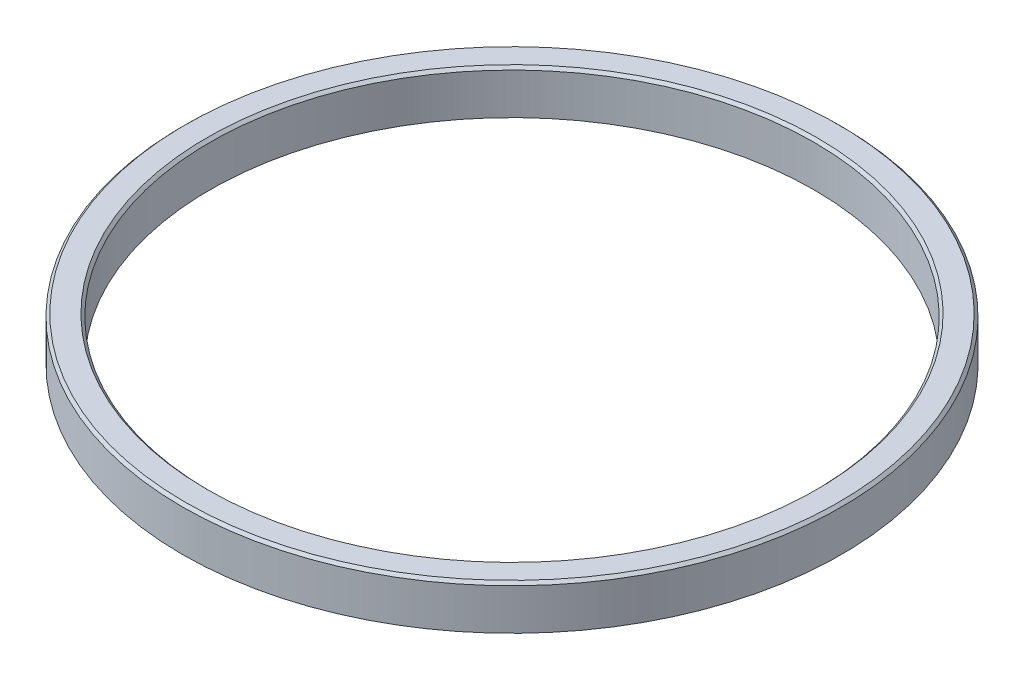
ISO-10303-21;
HEADER;
FILE_DESCRIPTION(('STEP AP214'),'2;1');
FILE_NAME('part.step','',(''),(''),'','','');
FILE_SCHEMA(('AUTOMOTIVE_DESIGN { 1 0 10303 214 1 1 1 1 }'));
ENDSEC;
DATA;
#1=APPLICATION_CONTEXT('core data for automotive mechanical design processes');
#2=APPLICATION_PROTOCOL_DEFINITION('international standard','automotive_design',2000,#1);
#3=PRODUCT_CONTEXT('',#1,'mechanical');
#4=PRODUCT('Part','Part','',(#3));
#5=PRODUCT_RELATED_PRODUCT_CATEGORY('part','',(#4));
#6=PRODUCT_DEFINITION_FORMATION('','',#4);
#7=PRODUCT_DEFINITION_CONTEXT('part definition',#1,'design');
#8=PRODUCT_DEFINITION('design','',#6,#7);
#9=PRODUCT_DEFINITION_SHAPE('','',#8);
#10=(LENGTH_UNIT() NAMED_UNIT(*) SI_UNIT(.MILLI.,.METRE.));
#11=(NAMED_UNIT(*) PLANE_ANGLE_UNIT() SI_UNIT($,.RADIAN.));
#12=(NAMED_UNIT(*) SI_UNIT($,.STERADIAN.) SOLID_ANGLE_UNIT());
#13=UNCERTAINTY_MEASURE_WITH_UNIT(LENGTH_MEASURE(1.E-05),#10,'distance_accuracy_value','');
#14=(GEOMETRIC_REPRESENTATION_CONTEXT(3) GLOBAL_UNCERTAINTY_ASSIGNED_CONTEXT((#13)) GLOBAL_UNIT_ASSIGNED_CONTEXT((#10,
#11,#12)) REPRESENTATION_CONTEXT('',''));
#15=CARTESIAN_POINT('',(0.,0.,0.));
#16=DIRECTION('',(0.,0.,1.));
#17=DIRECTION('',(1.,0.,0.));
#18=AXIS2_PLACEMENT_3D('',#15,#16,#17);
#19=CARTESIAN_POINT('',(0.,9.525,0.));
#20=DIRECTION('',(0.,1.,0.));
#21=DIRECTION('',(0.,0.,1.));
#22=AXIS2_PLACEMENT_3D('',#19,#20,#21);
#23=CONICAL_SURFACE('',#22,69.85,0.785398163397448);
#24=CARTESIAN_POINT('',(0.,9.525,0.));
#25=DIRECTION('',(0.,1.,0.));
#26=DIRECTION('',(0.,0.,1.));
#27=AXIS2_PLACEMENT_3D('',#24,#25,#26);
#28=CIRCLE('',#27,69.85);
#29=CARTESIAN_POINT('',(0.,9.525,69.85));
#30=VERTEX_POINT('',#29);
#31=EDGE_CURVE('E43',#30,#30,#28,.T.);
#32=ORIENTED_EDGE('',*,*,#31,.F.);
#33=EDGE_LOOP('',(#32));
#34=FACE_BOUND('',#33,.T.);
#35=CARTESIAN_POINT('',(0.,10.16,0.));
#36=DIRECTION('',(0.,1.,0.));
#37=DIRECTION('',(0.,0.,1.));
#38=AXIS2_PLACEMENT_3D('',#35,#36,#37);
#39=CIRCLE('',#38,70.485);
#40=CARTESIAN_POINT('',(0.,10.16,70.485));
#41=VERTEX_POINT('',#40);
#42=EDGE_CURVE('E12',#41,#41,#39,.F.);
#43=ORIENTED_EDGE('',*,*,#42,.F.);
#44=EDGE_LOOP('',(#43));
#45=FACE_BOUND('',#44,.T.);
#46=ADVANCED_FACE('F37',(#34,#45),#23,.F.);
#47=CARTESIAN_POINT('',(0.,9.525,0.));
#48=DIRECTION('',(0.,-1.,0.));
#49=DIRECTION('',(0.,0.,-1.));
#50=AXIS2_PLACEMENT_3D('',#47,#48,#49);
#51=CONICAL_SURFACE('',#50,76.2,0.785398163397448);
#52=CARTESIAN_POINT('',(0.,9.525,0.));
#53=DIRECTION('',(0.,1.,0.));
#54=DIRECTION('',(0.,0.,1.));
#55=AXIS2_PLACEMENT_3D('',#52,#53,#54);
#56=CIRCLE('',#55,76.2);
#57=CARTESIAN_POINT('',(0.,9.525,76.2));
#58=VERTEX_POINT('',#57);
#59=EDGE_CURVE('E51',#58,#58,#56,.F.);
#60=ORIENTED_EDGE('',*,*,#59,.F.);
#61=EDGE_LOOP('',(#60));
#62=FACE_BOUND('',#61,.T.);
#63=CARTESIAN_POINT('',(0.,10.16,0.));
#64=DIRECTION('',(0.,1.,0.));
#65=DIRECTION('',(0.,0.,1.));
#66=AXIS2_PLACEMENT_3D('',#63,#64,#65);
#67=CIRCLE('',#66,75.565);
#68=CARTESIAN_POINT('',(0.,10.16,75.565));
#69=VERTEX_POINT('',#68);
#70=EDGE_CURVE('E47',#69,#69,#67,.T.);
#71=ORIENTED_EDGE('',*,*,#70,.F.);
#72=EDGE_LOOP('',(#71));
#73=FACE_BOUND('',#72,.T.);
#74=ADVANCED_FACE('F76',(#62,#73),#51,.T.);
#75=CARTESIAN_POINT('',(0.,10.16,0.));
#76=DIRECTION('',(0.,1.,0.));
#77=DIRECTION('',(0.,0.,1.));
#78=AXIS2_PLACEMENT_3D('',#75,#76,#77);
#79=PLANE('',#78);
#80=ORIENTED_EDGE('',*,*,#42,.T.);
#81=EDGE_LOOP('',(#80));
#82=FACE_BOUND('',#81,.T.);
#83=ORIENTED_EDGE('',*,*,#70,.T.);
#84=EDGE_LOOP('',(#83));
#85=FACE_BOUND('',#84,.T.);
#86=ADVANCED_FACE('F81',(#82,#85),#79,.T.);
#87=CARTESIAN_POINT('',(0.,0.,0.));
#88=DIRECTION('',(0.,1.,0.));
#89=DIRECTION('',(0.,0.,1.));
#90=AXIS2_PLACEMENT_3D('',#87,#88,#89);
#91=PLANE('',#90);
#92=CARTESIAN_POINT('',(0.,0.,0.));
#93=DIRECTION('',(0.,1.,0.));
#94=DIRECTION('',(0.,0.,1.));
#95=AXIS2_PLACEMENT_3D('',#92,#93,#94);
#96=CIRCLE('',#95,76.2);
#97=CARTESIAN_POINT('',(0.,0.,76.2));
#98=VERTEX_POINT('',#97);
#99=EDGE_CURVE('E56',#98,#98,#96,.T.);
#100=ORIENTED_EDGE('',*,*,#99,.F.);
#101=EDGE_LOOP('',(#100));
#102=FACE_BOUND('',#101,.T.);
#103=CARTESIAN_POINT('',(0.,0.,0.));
#104=DIRECTION('',(0.,1.,0.));
#105=DIRECTION('',(0.,0.,1.));
#106=AXIS2_PLACEMENT_3D('',#103,#104,#105);
#107=CIRCLE('',#106,69.85);
#108=CARTESIAN_POINT('',(0.,0.,69.85));
#109=VERTEX_POINT('',#108);
#110=EDGE_CURVE('E59',#109,#109,#107,.T.);
#111=ORIENTED_EDGE('',*,*,#110,.T.);
#112=EDGE_LOOP('',(#111));
#113=FACE_BOUND('',#112,.T.);
#114=ADVANCED_FACE('F63',(#102,#113),#91,.F.);
#115=CARTESIAN_POINT('',(0.,10.16,0.));
#116=DIRECTION('',(0.,-1.,0.));
#117=DIRECTION('',(0.,0.,-1.));
#118=AXIS2_PLACEMENT_3D('',#115,#116,#117);
#119=CYLINDRICAL_SURFACE('',#118,76.2);
#120=ORIENTED_EDGE('',*,*,#59,.T.);
#121=EDGE_LOOP('',(#120));
#122=FACE_BOUND('',#121,.T.);
#123=ORIENTED_EDGE('',*,*,#99,.T.);
#124=EDGE_LOOP('',(#123));
#125=FACE_BOUND('',#124,.T.);
#126=ADVANCED_FACE('F67',(#122,#125),#119,.T.);
#127=CARTESIAN_POINT('',(0.,10.16,0.));
#128=DIRECTION('',(0.,-1.,0.));
#129=DIRECTION('',(0.,0.,-1.));
#130=AXIS2_PLACEMENT_3D('',#127,#128,#129);
#131=CYLINDRICAL_SURFACE('',#130,69.85);
#132=ORIENTED_EDGE('',*,*,#31,.T.);
#133=EDGE_LOOP('',(#132));
#134=FACE_BOUND('',#133,.T.);
#135=ORIENTED_EDGE('',*,*,#110,.F.);
#136=EDGE_LOOP('',(#135));
#137=FACE_BOUND('',#136,.T.);
#138=ADVANCED_FACE('F65',(#134,#137),#131,.F.);
#139=CLOSED_SHELL('',(#46,#74,#86,#114,#126,#138));
#140=MANIFOLD_SOLID_BREP('B2',#139);
#141=ADVANCED_BREP_SHAPE_REPRESENTATION('',(#18,#140),#14);
#142=SHAPE_DEFINITION_REPRESENTATION(#9,#141);
ENDSEC;
END-ISO-10303-21;
